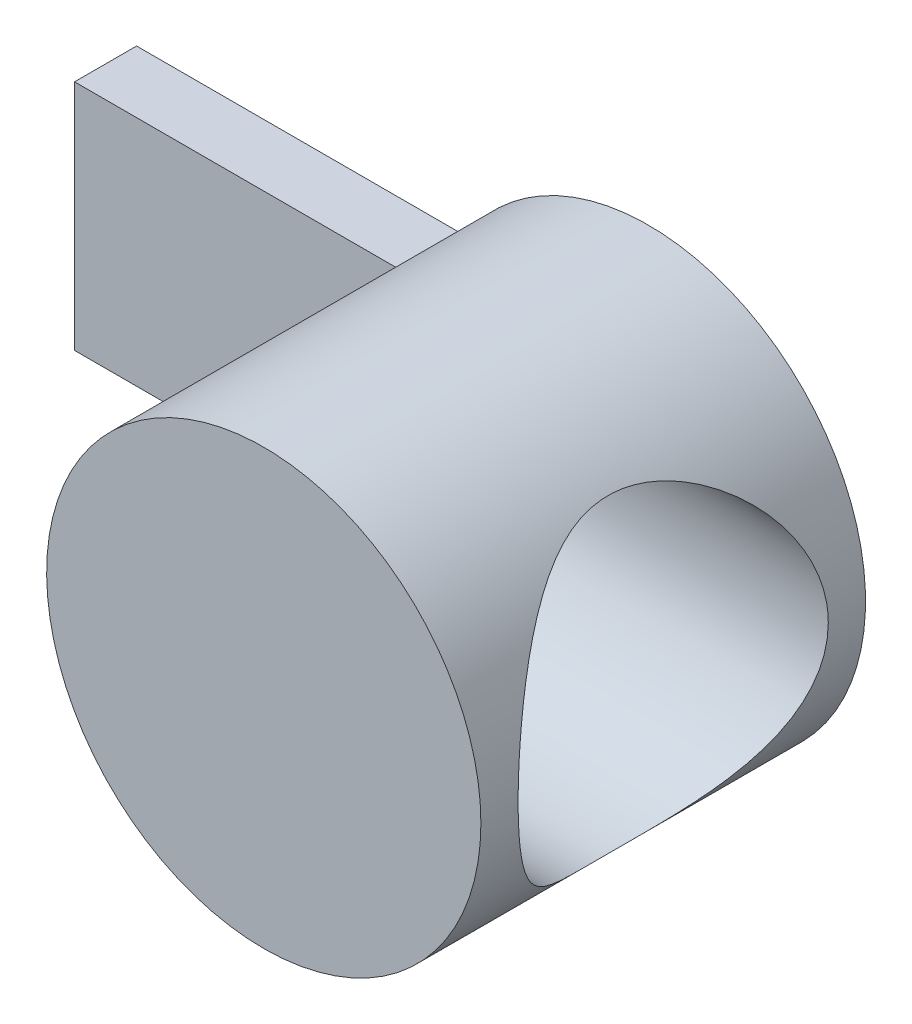
ISO-10303-21;
HEADER;
FILE_DESCRIPTION(('STEP AP214'),'2;1');
FILE_NAME('part.step','',(''),(''),'','','');
FILE_SCHEMA(('AUTOMOTIVE_DESIGN { 1 0 10303 214 1 1 1 1 }'));
ENDSEC;
DATA;
#1=APPLICATION_CONTEXT('core data for automotive mechanical design processes');
#2=APPLICATION_PROTOCOL_DEFINITION('international standard','automotive_design',2000,#1);
#3=PRODUCT_CONTEXT('',#1,'mechanical');
#4=PRODUCT('Part','Part','',(#3));
#5=PRODUCT_RELATED_PRODUCT_CATEGORY('part','',(#4));
#6=PRODUCT_DEFINITION_FORMATION('','',#4);
#7=PRODUCT_DEFINITION_CONTEXT('part definition',#1,'design');
#8=PRODUCT_DEFINITION('design','',#6,#7);
#9=PRODUCT_DEFINITION_SHAPE('','',#8);
#10=(LENGTH_UNIT() NAMED_UNIT(*) SI_UNIT(.MILLI.,.METRE.));
#11=(NAMED_UNIT(*) PLANE_ANGLE_UNIT() SI_UNIT($,.RADIAN.));
#12=(NAMED_UNIT(*) SI_UNIT($,.STERADIAN.) SOLID_ANGLE_UNIT());
#13=UNCERTAINTY_MEASURE_WITH_UNIT(LENGTH_MEASURE(1.E-05),#10,'distance_accuracy_value','');
#14=(GEOMETRIC_REPRESENTATION_CONTEXT(3) GLOBAL_UNCERTAINTY_ASSIGNED_CONTEXT((#13)) GLOBAL_UNIT_ASSIGNED_CONTEXT((#10,
#11,#12)) REPRESENTATION_CONTEXT('',''));
#15=CARTESIAN_POINT('',(0.,0.,0.));
#16=DIRECTION('',(0.,0.,1.));
#17=DIRECTION('',(1.,0.,0.));
#18=AXIS2_PLACEMENT_3D('',#15,#16,#17);
#19=CARTESIAN_POINT('',(0.,0.,12.4));
#20=DIRECTION('',(0.,0.,-1.));
#21=DIRECTION('',(-1.,0.,0.));
#22=AXIS2_PLACEMENT_3D('',#19,#20,#21);
#23=CYLINDRICAL_SURFACE('',#22,7.);
#24=CARTESIAN_POINT('',(-7.,0.,9.3));
#25=CARTESIAN_POINT('',(-6.99999920392225,-0.0826004723301821,9.29999895107974));
#26=CARTESIAN_POINT('',(-6.99853258915526,-0.165226028062722,9.29669200863502));
#27=CARTESIAN_POINT('',(-6.99271063918879,-0.329862806737177,9.2835092069616));
#28=CARTESIAN_POINT('',(-6.98835361198698,-0.411873641376801,9.27362950012956));
#29=CARTESIAN_POINT('',(-6.97106831380025,-0.656353947984344,9.23420603218676));
#30=CARTESIAN_POINT('',(-6.95392618552208,-0.81707459126903,9.19487820195585));
#31=CARTESIAN_POINT('',(-6.91024201837554,-1.12839184611795,9.091985157778));
#32=CARTESIAN_POINT('',(-6.88373344646924,-1.27902226044992,9.02850617639884));
#33=CARTESIAN_POINT('',(-6.82385816705202,-1.56736705923941,8.87949417247548));
#34=CARTESIAN_POINT('',(-6.79049305272456,-1.70508443335958,8.79396627203652));
#35=CARTESIAN_POINT('',(-6.71812812036478,-1.97149031653573,8.59831430986218));
#36=CARTESIAN_POINT('',(-6.67892881061503,-2.09937136480753,8.48716605823135));
#37=CARTESIAN_POINT('',(-6.60011042175858,-2.33539098465528,8.2456024476056));
#38=CARTESIAN_POINT('',(-6.56049110877726,-2.4435178713242,8.11517576708566));
#39=CARTESIAN_POINT('',(-6.48275819983901,-2.64310034346877,7.82973711598425));
#40=CARTESIAN_POINT('',(-6.44486051581786,-2.73324780222564,7.6737453510934));
#41=CARTESIAN_POINT('',(-6.37808030665534,-2.8856656695792,7.34690560801862));
#42=CARTESIAN_POINT('',(-6.34919255707983,-2.94795224251508,7.17606631297851));
#43=CARTESIAN_POINT('',(-6.30589043947932,-3.03944104406133,6.8336584512215));
#44=CARTESIAN_POINT('',(-6.29079733105656,-3.07020506562793,6.66259661902924));
#45=CARTESIAN_POINT('',(-6.27487325052694,-3.10263243322904,6.31712509979002));
#46=CARTESIAN_POINT('',(-6.27403285732557,-3.10431500221929,6.14271770052024));
#47=CARTESIAN_POINT('',(-6.28614249218708,-3.07969715606084,5.81206003550467));
#48=CARTESIAN_POINT('',(-6.29787545719193,-3.05586653665104,5.65557185096969));
#49=CARTESIAN_POINT('',(-6.33173023253464,-2.98508207384368,5.34910027026295));
#50=CARTESIAN_POINT('',(-6.35385435576186,-2.93812308236336,5.19911833038975));
#51=CARTESIAN_POINT('',(-6.4065108723195,-2.82148454209153,4.90590173161919));
#52=CARTESIAN_POINT('',(-6.43722044365776,-2.75131979908782,4.76289334649958));
#53=CARTESIAN_POINT('',(-6.50355949564245,-2.59061005373219,4.49007861638155));
#54=CARTESIAN_POINT('',(-6.5391910387095,-2.50005649792035,4.36027784548411));
#55=CARTESIAN_POINT('',(-6.61554078300587,-2.29088616623155,4.10435699213324));
#56=CARTESIAN_POINT('',(-6.65641777275303,-2.17040299141221,3.9798050633688));
#57=CARTESIAN_POINT('',(-6.73578240441094,-1.90991248824909,3.75210907729281));
#58=CARTESIAN_POINT('',(-6.7742693316775,-1.76989936055896,3.64897140158507));
#59=CARTESIAN_POINT('',(-6.84591281994174,-1.46902881817355,3.46431236039027));
#60=CARTESIAN_POINT('',(-6.87888139019415,-1.30768291995535,3.38350841081081));
#61=CARTESIAN_POINT('',(-6.93429049507521,-0.971852684390511,3.25075508019859));
#62=CARTESIAN_POINT('',(-6.95673761767747,-0.797376648091998,3.19878763951207));
#63=CARTESIAN_POINT('',(-6.98729435528213,-0.453273192256998,3.12864832850276));
#64=CARTESIAN_POINT('',(-6.99629273330759,-0.284152822899404,3.1083769490579));
#65=CARTESIAN_POINT('',(-7.00183669249172,0.055302211411913,3.09584808617045));
#66=CARTESIAN_POINT('',(-6.99838646319975,0.225636448583719,3.10358117789249));
#67=CARTESIAN_POINT('',(-6.97998496338462,0.552322710255016,3.1454130866267));
#68=CARTESIAN_POINT('',(-6.96570753654674,0.708915012097869,3.17796772637589));
#69=CARTESIAN_POINT('',(-6.92784742700373,1.01420149026936,3.26628970682303));
#70=CARTESIAN_POINT('',(-6.90426361059403,1.16289470182571,3.32205987568271));
#71=CARTESIAN_POINT('',(-6.84909438777876,1.45343201362728,3.45700965214373));
#72=CARTESIAN_POINT('',(-6.81728219743294,1.5949174510053,3.53686562538259));
#73=CARTESIAN_POINT('',(-6.74895803141339,1.86299030953334,3.71698300286541));
#74=CARTESIAN_POINT('',(-6.71244401454198,1.98957121423694,3.81725328059522));
#75=CARTESIAN_POINT('',(-6.6349796327071,2.2349264374936,4.04470917997253));
#76=CARTESIAN_POINT('',(-6.5939081551196,2.35226400881663,4.1734071131829));
#77=CARTESIAN_POINT('',(-6.51444139889945,2.5641546083995,4.44918266462703));
#78=CARTESIAN_POINT('',(-6.47604705067427,2.65869974317004,4.59626662361713));
#79=CARTESIAN_POINT('',(-6.4056559774341,2.82415833145881,4.90920710650133));
#80=CARTESIAN_POINT('',(-6.37382590078898,2.89448101020183,5.07541640225551));
#81=CARTESIAN_POINT('',(-6.32225755658587,3.00547362590972,5.41918720208858));
#82=CARTESIAN_POINT('',(-6.30250756681331,3.04617231656578,5.59673751571235));
#83=CARTESIAN_POINT('',(-6.27928486291416,3.09373854164963,5.9420262458586));
#84=CARTESIAN_POINT('',(-6.27457978714274,3.1031699433841,6.10932920549811));
#85=CARTESIAN_POINT('',(-6.27863612118093,3.09495641516909,6.44308355830446));
#86=CARTESIAN_POINT('',(-6.28739471419524,3.07731714879828,6.60953512228618));
#87=CARTESIAN_POINT('',(-6.31620554797265,3.01770297873168,6.92660854462708));
#88=CARTESIAN_POINT('',(-6.33555708545857,2.97723361477951,7.07758371882228));
#89=CARTESIAN_POINT('',(-6.38273680736285,2.87468918464525,7.3705860881766));
#90=CARTESIAN_POINT('',(-6.41056743775042,2.81260788331605,7.51261068707141));
#91=CARTESIAN_POINT('',(-6.47376726319116,2.6640646190602,7.79361644150932));
#92=CARTESIAN_POINT('',(-6.50950448670628,2.57629841908578,7.93182345761236));
#93=CARTESIAN_POINT('',(-6.58360232894903,2.380570945934,8.19234706879388));
#94=CARTESIAN_POINT('',(-6.62196402921168,2.27260131482343,8.31465705183381));
#95=CARTESIAN_POINT('',(-6.70097060806761,2.02850610359402,8.55084120757505));
#96=CARTESIAN_POINT('',(-6.74152553582918,1.89075199028391,8.66306771609541));
#97=CARTESIAN_POINT('',(-6.81711404156367,1.59683926292868,8.86301335953832));
#98=CARTESIAN_POINT('',(-6.85214509794284,1.44067230011921,8.95072131601678));
#99=CARTESIAN_POINT('',(-6.89742322426797,1.1968062420193,9.06103704115569));
#100=CARTESIAN_POINT('',(-6.91125017984811,1.11437615014362,9.09414773548195));
#101=CARTESIAN_POINT('',(-6.93621412332348,0.946626613697481,9.15326772962415));
#102=CARTESIAN_POINT('',(-6.94735240296889,0.861308579168792,9.17928044038893));
#103=CARTESIAN_POINT('',(-6.96658500833041,0.688641654886188,9.22385659736424));
#104=CARTESIAN_POINT('',(-6.97468662123244,0.601298168057098,9.24243788428135));
#105=CARTESIAN_POINT('',(-6.98763502402816,0.425139501168101,9.27200613974835));
#106=CARTESIAN_POINT('',(-6.99248408251947,0.336325391237433,9.28299840166231));
#107=CARTESIAN_POINT('',(-6.99708708624893,0.206077044210543,9.29341789744742));
#108=CARTESIAN_POINT('',(-6.99817853645028,0.164910252675197,9.29588518180084));
#109=CARTESIAN_POINT('',(-6.9996351961203,0.082497726740249,9.29917650406863));
#110=CARTESIAN_POINT('',(-7.00000039757391,0.0412519914744309,9.30000052384749));
#111=CARTESIAN_POINT('',(-7.,0.,9.3));
#112=B_SPLINE_CURVE_WITH_KNOTS('',3,(#24,#25,#26,#27,#28,#29,#30,#31,#32,#33,#34,#35,#36,#37,
#38,#39,#40,#41,#42,#43,#44,#45,#46,#47,#48,#49,#50,#51,#52,#53,#54,#55,#56,#57,#58,#59,#60,#61,
#62,#63,#64,#65,#66,#67,#68,#69,#70,#71,#72,#73,#74,#75,#76,#77,#78,#79,#80,#81,#82,#83,#84,#85,
#86,#87,#88,#89,#90,#91,#92,#93,#94,#95,#96,#97,#98,#99,#100,#101,#102,#103,#104,#105,#106,#107,
#108,#109,#110,#111),.UNSPECIFIED.,.T.,.F.,(4,2,2,2,2,2,2,2,2,2,2,2,2,2,2,2,2,2,2,2,2,2,2,2,2,2,
2,2,2,2,2,2,2,2,2,2,2,2,2,2,2,2,2,4),(0.,0.247756788055554,0.495658737198749,0.992044630234383,
1.48667454444317,1.98118965633366,2.5006840191714,3.020484683399,3.57003144751924,
4.1192589605216,4.6397235516738,5.15984410049578,5.6338122404858,6.10788592749307,
6.59257463123686,7.07746705039858,7.60922292755884,8.141137045125,8.68854995296803,
9.23561964042515,9.74463230675549,10.2534736820574,10.733008502137,11.2126017572017,
11.7071650616782,12.2019437987223,12.7363418968097,13.2709248029259,13.8177502093522,
14.3640441447254,14.8642626981315,15.3643766127848,15.834826048662,16.3054113240846,
16.8060613839441,17.3069190168579,17.8511484172661,18.3956255383699,18.6650270977702,
18.9342989668481,19.2029204544772,19.4713543881329,19.595086708619,19.7188203946413),.UNSPECIFIED.);
#113=CARTESIAN_POINT('',(-7.,0.,9.3));
#114=VERTEX_POINT('',#113);
#115=EDGE_CURVE('E39',#114,#114,#112,.T.);
#116=ORIENTED_EDGE('',*,*,#115,.T.);
#117=EDGE_LOOP('',(#116));
#118=FACE_BOUND('',#117,.T.);
#119=CARTESIAN_POINT('',(7.,0.,1.2));
#120=CARTESIAN_POINT('',(7.00000020838972,-0.123706830347803,1.19999977645311));
#121=CARTESIAN_POINT('',(6.9967139987286,-0.247410973485874,1.20459731763598));
#122=CARTESIAN_POINT('',(6.98364877001323,-0.493842597599125,1.2229133669717));
#123=CARTESIAN_POINT('',(6.97386724806996,-0.616569683621373,1.23663539113509));
#124=CARTESIAN_POINT('',(6.94804684346392,-0.860016934543372,1.27298079601445));
#125=CARTESIAN_POINT('',(6.93200830974386,-0.980737210968061,1.29560368034545));
#126=CARTESIAN_POINT('',(6.89403980063153,-1.21935225441358,1.34941777791251));
#127=CARTESIAN_POINT('',(6.87210728454189,-1.33724577898901,1.38061268639059));
#128=CARTESIAN_POINT('',(6.82296817560751,-1.56876671294682,1.45094481401108));
#129=CARTESIAN_POINT('',(6.79579130680713,-1.68241404829323,1.4900373269336));
#130=CARTESIAN_POINT('',(6.73663568699671,-1.90554075562293,1.57580066790878));
#131=CARTESIAN_POINT('',(6.70465504948954,-2.01501846887803,1.622474473814));
#132=CARTESIAN_POINT('',(6.60241573373069,-2.33634582627582,1.77310823468496));
#133=CARTESIAN_POINT('',(6.5258150865612,-2.54129209226534,1.88774310148879));
#134=CARTESIAN_POINT('',(6.35349136110254,-2.94722710575678,2.15303366766681));
#135=CARTESIAN_POINT('',(6.25666965742087,-3.14621427453547,2.30599715160335));
#136=CARTESIAN_POINT('',(6.05567589289303,-3.51757946240277,2.63787428407187));
#137=CARTESIAN_POINT('',(5.95149294556457,-3.68991681632733,2.81682679821524));
#138=CARTESIAN_POINT('',(5.78580169781969,-3.9417150806784,3.12032565347204));
#139=CARTESIAN_POINT('',(5.72420876579618,-4.03039974891772,3.23731537762762));
#140=CARTESIAN_POINT('',(5.60277478999017,-4.19756740724372,3.47932676985867));
#141=CARTESIAN_POINT('',(5.54293422728727,-4.2760476158605,3.6043506140081));
#142=CARTESIAN_POINT('',(5.4270606468648,-4.42218280560563,3.86201101128069));
#143=CARTESIAN_POINT('',(5.37102235890232,-4.48985295423517,3.99463653688092));
#144=CARTESIAN_POINT('',(5.2649167619883,-4.61381658166145,4.26734449592868));
#145=CARTESIAN_POINT('',(5.21484853251546,-4.67011181528465,4.40742577494594));
#146=CARTESIAN_POINT('',(5.10685206277554,-4.78838198824486,4.74607281108786));
#147=CARTESIAN_POINT('',(5.0524828289815,-4.84522975768853,4.94768828615543));
#148=CARTESIAN_POINT('',(4.98781463924069,-4.91148095083961,5.25738617406959));
#149=CARTESIAN_POINT('',(4.96907802082194,-4.93038988462307,5.36177710605744));
#150=CARTESIAN_POINT('',(4.93791198912564,-4.96160430011133,5.57246334187762));
#151=CARTESIAN_POINT('',(4.92548008185896,-4.97391239305786,5.67875787543776));
#152=CARTESIAN_POINT('',(4.9074041133857,-4.99174806834479,5.89322513655137));
#153=CARTESIAN_POINT('',(4.90180679564492,-4.99722896284026,6.00140572146472));
#154=CARTESIAN_POINT('',(4.89781588192549,-5.00114067376557,6.21802681215551));
#155=CARTESIAN_POINT('',(4.89942206309633,-4.9995717082929,6.32646730978846));
#156=CARTESIAN_POINT('',(4.9097647058501,-4.9894149735773,6.54272888939918));
#157=CARTESIAN_POINT('',(4.91850485918776,-4.98082357029426,6.65054962155586));
#158=CARTESIAN_POINT('',(4.94272114520741,-4.95679292982465,6.86469846955641));
#159=CARTESIAN_POINT('',(4.95820063893991,-4.94135027570228,6.97102581326793));
#160=CARTESIAN_POINT('',(4.99760451378595,-4.90151284488867,7.19482508146929));
#161=CARTESIAN_POINT('',(5.02235272142097,-4.87622911468844,7.31199391044316));
#162=CARTESIAN_POINT('',(5.07843189223478,-4.81779740683445,7.54276673574008));
#163=CARTESIAN_POINT('',(5.10976728413097,-4.78464413635863,7.65636827432982));
#164=CARTESIAN_POINT('',(5.21188277843352,-4.6740034304818,7.99137244482137));
#165=CARTESIAN_POINT('',(5.29073017996701,-4.58537486342022,8.20675876983911));
#166=CARTESIAN_POINT('',(5.43117977056448,-4.41699659938633,8.5479540095639));
#167=CARTESIAN_POINT('',(5.48936415421452,-4.34470821312944,8.67905841197645));
#168=CARTESIAN_POINT('',(5.60880434984662,-4.18937966154036,8.93336368670042));
#169=CARTESIAN_POINT('',(5.67006102833912,-4.10633645234857,9.05656230667668));
#170=CARTESIAN_POINT('',(5.793752422172,-3.9298928370481,9.29482566922712));
#171=CARTESIAN_POINT('',(5.85618806526486,-3.83648396587932,9.40988363634829));
#172=CARTESIAN_POINT('',(5.98049354239989,-3.63967604580747,9.63142884548284));
#173=CARTESIAN_POINT('',(6.04236343357916,-3.53627801821644,9.73791696165918));
#174=CARTESIAN_POINT('',(6.16459711373884,-3.31865566402193,9.9428718998703));
#175=CARTESIAN_POINT('',(6.22493938999143,-3.20433257193991,10.0412468818249));
#176=CARTESIAN_POINT('',(6.34192222059401,-2.96607983417464,10.2280612669858));
#177=CARTESIAN_POINT('',(6.3985632904349,-2.84215153154958,10.3165020550304));
#178=CARTESIAN_POINT('',(6.50656183204898,-2.58534749281631,10.482441595));
#179=CARTESIAN_POINT('',(6.55792871427446,-2.45248841807631,10.5599599306667));
#180=CARTESIAN_POINT('',(6.65402794776657,-2.17829997878349,10.7032109939681));
#181=CARTESIAN_POINT('',(6.69876279357063,-2.03697382721867,10.7689481548617));
#182=CARTESIAN_POINT('',(6.76979900167759,-1.78393161589397,10.8723873256715));
#183=CARTESIAN_POINT('',(6.79788920127107,-1.67388190691354,10.9129602050567));
#184=CARTESIAN_POINT('',(6.84910120159546,-1.45016241863131,10.9865317316341));
#185=CARTESIAN_POINT('',(6.87222406946424,-1.33649342290229,11.0195320057622));
#186=CARTESIAN_POINT('',(6.91302945246583,-1.10620699746514,11.0775404731357));
#187=CARTESIAN_POINT('',(6.93071352231445,-0.98959042067674,11.1025509503959));
#188=CARTESIAN_POINT('',(6.96026202465165,-0.75419808669737,11.1442354109564));
#189=CARTESIAN_POINT('',(6.97212907243022,-0.635423324765778,11.1609131406635));
#190=CARTESIAN_POINT('',(6.98981803267421,-0.39609653194057,11.1857429290164));
#191=CARTESIAN_POINT('',(6.99561783247229,-0.275539612785596,11.1938638021502));
#192=CARTESIAN_POINT('',(7.00095849009119,-0.0340589156116064,11.2013424865321));
#193=CARTESIAN_POINT('',(7.00050163923066,0.0868647118914876,11.200703505825));
#194=CARTESIAN_POINT('',(6.99334434902713,0.328194873869988,11.1906790582753));
#195=CARTESIAN_POINT('',(6.98664219024223,0.448601256767225,11.1812911827097));
#196=CARTESIAN_POINT('',(6.96714954851426,0.687926838509061,11.1539140939111));
#197=CARTESIAN_POINT('',(6.95435917772169,0.806846064707051,11.1359250391197));
#198=CARTESIAN_POINT('',(6.92373169105251,1.03669034077474,11.0926764228558));
#199=CARTESIAN_POINT('',(6.90616594722286,1.14772530670986,11.0678068038953));
#200=CARTESIAN_POINT('',(6.86612520630985,1.36703042618004,11.0108296504221));
#201=CARTESIAN_POINT('',(6.84364861236167,1.47529966756195,10.9787197614764));
#202=CARTESIAN_POINT('',(6.76946421834351,1.79502091246228,10.8720751794697));
#203=CARTESIAN_POINT('',(6.71097815818561,2.00155706076148,10.7871927909131));
#204=CARTESIAN_POINT('',(6.57387491863986,2.41580133963063,10.5842822855905));
#205=CARTESIAN_POINT('',(6.49391167742686,2.62191172181248,10.4639437037929));
#206=CARTESIAN_POINT('',(6.32248637138391,3.01190946129235,10.1980208898307));
#207=CARTESIAN_POINT('',(6.23101540686785,3.1957794003542,10.0524170849791));
#208=CARTESIAN_POINT('',(6.0250635299762,3.57103500131532,9.71046418552866));
#209=CARTESIAN_POINT('',(5.9094144469246,3.75775754044495,9.50970030994848));
#210=CARTESIAN_POINT('',(5.67976360472222,4.09660125204316,9.07973003591422));
#211=CARTESIAN_POINT('',(5.56576275441127,4.24870396900494,8.85050856713161));
#212=CARTESIAN_POINT('',(5.36830225813508,4.49468870359569,8.40283415030589));
#213=CARTESIAN_POINT('',(5.28284827698324,4.59394222437956,8.18822765934173));
#214=CARTESIAN_POINT('',(5.13141345636178,4.76250754552228,7.74119845383935));
#215=CARTESIAN_POINT('',(5.06539151754964,4.83188268572654,7.50881467056927));
#216=CARTESIAN_POINT('',(4.97281140949568,4.92694108133025,7.07463559032775));
#217=CARTESIAN_POINT('',(4.94119323485648,4.95835553271174,6.87520480558969));
#218=CARTESIAN_POINT('',(4.90241792810042,4.99670946606584,6.47172766179928));
#219=CARTESIAN_POINT('',(4.89523352826001,5.00367623156318,6.26768670389023));
#220=CARTESIAN_POINT('',(4.90648075072078,4.99264295050726,5.86101491332858));
#221=CARTESIAN_POINT('',(4.92491410752053,4.97464121341455,5.65838417709128));
#222=CARTESIAN_POINT('',(4.98443760917989,4.9149871096555,5.25997752126032));
#223=CARTESIAN_POINT('',(5.02556280172843,4.87329815495586,5.06421270482885));
#224=CARTESIAN_POINT('',(5.1420026145228,4.75069025016355,4.61855770549582));
#225=CARTESIAN_POINT('',(5.22418017553764,4.66126522644891,4.37280248816455));
#226=CARTESIAN_POINT('',(5.36059508623753,4.50210411725644,4.02107405363224));
#227=CARTESIAN_POINT('',(5.40832357564202,4.44479567507594,3.90652093393072));
#228=CARTESIAN_POINT('',(5.50678597491543,4.32220971449382,3.68311353915327));
#229=CARTESIAN_POINT('',(5.55751965778047,4.25693279761429,3.57425883480216));
#230=CARTESIAN_POINT('',(5.71505652733019,4.04590690194063,3.25074078714441));
#231=CARTESIAN_POINT('',(5.82467625637419,3.88776756391514,3.0452887413705));
#232=CARTESIAN_POINT('',(5.98735914065858,3.6279551096738,2.75693618844453));
#233=CARTESIAN_POINT('',(6.04132015327539,3.53753675683206,2.66408465013388));
#234=CARTESIAN_POINT('',(6.14770901514369,3.34923083939283,2.48523041156896));
#235=CARTESIAN_POINT('',(6.2001365887339,3.25134194311757,2.39922893799781));
#236=CARTESIAN_POINT('',(6.31122907951896,3.03086404240044,2.22038591721264));
#237=CARTESIAN_POINT('',(6.36941716980575,2.90692152521496,2.12890950870005));
#238=CARTESIAN_POINT('',(6.48069645050252,2.64956836988843,1.95692065557396));
#239=CARTESIAN_POINT('',(6.53378994050182,2.51616205124388,1.87640325737379));
#240=CARTESIAN_POINT('',(6.63333305417821,2.24060912964319,1.72739711081934));
#241=CARTESIAN_POINT('',(6.67978935099169,2.09847151388446,1.6588962648185));
#242=CARTESIAN_POINT('',(6.76463878724721,1.80631427486925,1.53498359895766));
#243=CARTESIAN_POINT('',(6.80303505370809,1.65629773671334,1.47956670192386));
#244=CARTESIAN_POINT('',(6.86305258081175,1.38331089815878,1.39352344182651));
#245=CARTESIAN_POINT('',(6.88650604727471,1.26160961479056,1.36012583943568));
#246=CARTESIAN_POINT('',(6.92714135495755,1.0150426318104,1.30247951146532));
#247=CARTESIAN_POINT('',(6.94432457497392,0.890177634349851,1.27822877449537));
#248=CARTESIAN_POINT('',(6.97198481931339,0.638329109483767,1.23927826321901));
#249=CARTESIAN_POINT('',(6.98246701467067,0.511347293416879,1.22457112419438));
#250=CARTESIAN_POINT('',(6.99647449097442,0.256242689441558,1.20493211695579));
#251=CARTESIAN_POINT('',(6.99999978417626,0.128119903543471,1.20000023152163));
#252=CARTESIAN_POINT('',(7.,0.,1.2));
#253=B_SPLINE_CURVE_WITH_KNOTS('',3,(#119,#120,#121,#122,#123,#124,#125,#126,#127,#128,#129,
#130,#131,#132,#133,#134,#135,#136,#137,#138,#139,#140,#141,#142,#143,#144,#145,#146,#147,#148,
#149,#150,#151,#152,#153,#154,#155,#156,#157,#158,#159,#160,#161,#162,#163,#164,#165,#166,#167,
#168,#169,#170,#171,#172,#173,#174,#175,#176,#177,#178,#179,#180,#181,#182,#183,#184,#185,#186,
#187,#188,#189,#190,#191,#192,#193,#194,#195,#196,#197,#198,#199,#200,#201,#202,#203,#204,#205,
#206,#207,#208,#209,#210,#211,#212,#213,#214,#215,#216,#217,#218,#219,#220,#221,#222,#223,#224,
#225,#226,#227,#228,#229,#230,#231,#232,#233,#234,#235,#236,#237,#238,#239,#240,#241,#242,#243,
#244,#245,#246,#247,#248,#249,#250,#251,#252),.UNSPECIFIED.,.T.,.F.,(4,2,2,2,2,2,2,2,2,2,2,2,2,
2,2,2,2,2,2,2,2,2,2,2,2,2,2,2,2,2,2,2,2,2,2,2,2,2,2,2,2,2,2,2,2,2,2,2,2,2,2,2,2,2,2,2,2,2,2,2,2,
2,2,2,2,2,4),(0.,0.370988075311342,0.742119189353149,1.11322960901298,1.48450025920444,
1.85372534219339,2.22309580520344,2.96119440682996,3.76545645669383,4.57093387736644,
5.04808282383801,5.52536155725331,6.00196462889924,6.47849411798938,7.12486898649108,
7.44773292534192,7.77046904731894,8.09540029733772,8.42032149521341,8.74541094303565,
9.07066270584137,9.43729317449982,9.80417093025883,10.5385885670457,11.0199765172867,
11.501501010235,11.9834216722646,12.4652931137676,12.9520296640933,13.4386982783501,
13.9244828884573,14.4100843121038,14.7715471013432,15.1329321592677,15.4942138166987,
15.8553328952545,16.2177635696493,16.5800615177667,16.9424592422916,17.304850291374,
17.6498662512386,17.9949945676154,18.6847309611871,19.4371210061711,20.190096543024,
21.0793568967469,21.9690902023821,22.7207890020039,23.4708863194346,24.0812720855668,
24.690976446486,25.3007220906012,25.9114121377249,26.7290171085949,27.1388076467791,
27.5485672699122,28.3895670350435,28.810455633468,29.2314194343296,29.724740195124,
30.2178372239682,30.7104349429707,31.2028411960805,31.587446153124,31.9719664863837,
32.356189734384,32.7404123055309),.UNSPECIFIED.);
#254=CARTESIAN_POINT('',(7.,0.,1.2));
#255=VERTEX_POINT('',#254);
#256=EDGE_CURVE('E11',#255,#255,#253,.T.);
#257=ORIENTED_EDGE('',*,*,#256,.T.);
#258=EDGE_LOOP('',(#257));
#259=FACE_BOUND('',#258,.T.);
#260=CARTESIAN_POINT('',(0.,0.,12.4));
#261=DIRECTION('',(0.,0.,1.));
#262=DIRECTION('',(1.,0.,0.));
#263=AXIS2_PLACEMENT_3D('',#260,#261,#262);
#264=CIRCLE('',#263,7.);
#265=CARTESIAN_POINT('',(7.,0.,12.4));
#266=VERTEX_POINT('',#265);
#267=EDGE_CURVE('E115',#266,#266,#264,.T.);
#268=ORIENTED_EDGE('',*,*,#267,.F.);
#269=EDGE_LOOP('',(#268));
#270=FACE_BOUND('',#269,.T.);
#271=DIRECTION('',(0.,0.,-1.));
#272=VECTOR('',#271,1.);
#273=CARTESIAN_POINT('',(-5.91079520876845,3.75,2.));
#274=LINE('',#273,#272);
#275=CARTESIAN_POINT('',(-5.91079520876845,3.75,2.));
#276=VERTEX_POINT('',#275);
#277=CARTESIAN_POINT('',(-5.91079520876845,3.75,0.));
#278=VERTEX_POINT('',#277);
#279=EDGE_CURVE('E55',#276,#278,#274,.T.);
#280=ORIENTED_EDGE('',*,*,#279,.F.);
#281=CARTESIAN_POINT('',(0.,0.,2.));
#282=DIRECTION('',(0.,0.,-1.));
#283=DIRECTION('',(-1.,0.,0.));
#284=AXIS2_PLACEMENT_3D('',#281,#282,#283);
#285=CIRCLE('',#284,7.);
#286=CARTESIAN_POINT('',(-5.91079520876845,-3.75,2.));
#287=VERTEX_POINT('',#286);
#288=EDGE_CURVE('E48',#287,#276,#285,.T.);
#289=ORIENTED_EDGE('',*,*,#288,.F.);
#290=DIRECTION('',(0.,0.,-1.));
#291=VECTOR('',#290,1.);
#292=CARTESIAN_POINT('',(-5.91079520876845,-3.75,2.));
#293=LINE('',#292,#291);
#294=CARTESIAN_POINT('',(-5.91079520876845,-3.75,0.));
#295=VERTEX_POINT('',#294);
#296=EDGE_CURVE('E101',#287,#295,#293,.T.);
#297=ORIENTED_EDGE('',*,*,#296,.T.);
#298=CARTESIAN_POINT('',(0.,0.,0.));
#299=DIRECTION('',(0.,0.,1.));
#300=DIRECTION('',(1.,0.,0.));
#301=AXIS2_PLACEMENT_3D('',#298,#299,#300);
#302=CIRCLE('',#301,7.);
#303=EDGE_CURVE('E114',#295,#278,#302,.T.);
#304=ORIENTED_EDGE('',*,*,#303,.T.);
#305=EDGE_LOOP('',(#280,#289,#297,#304));
#306=FACE_BOUND('',#305,.T.);
#307=ADVANCED_FACE('F35',(#118,#259,#270,#306),#23,.T.);
#308=CARTESIAN_POINT('',(0.,0.,12.4));
#309=DIRECTION('',(0.,0.,1.));
#310=DIRECTION('',(1.,0.,0.));
#311=AXIS2_PLACEMENT_3D('',#308,#309,#310);
#312=PLANE('',#311);
#313=ORIENTED_EDGE('',*,*,#267,.T.);
#314=EDGE_LOOP('',(#313));
#315=FACE_BOUND('',#314,.T.);
#316=ADVANCED_FACE('F141',(#315),#312,.T.);
#317=CARTESIAN_POINT('',(0.,0.,0.));
#318=DIRECTION('',(0.,0.,1.));
#319=DIRECTION('',(1.,0.,0.));
#320=AXIS2_PLACEMENT_3D('',#317,#318,#319);
#321=PLANE('',#320);
#322=ORIENTED_EDGE('',*,*,#303,.F.);
#323=DIRECTION('',(1.,0.,0.));
#324=VECTOR('',#323,1.);
#325=CARTESIAN_POINT('',(-5.91079520876845,-3.75,0.));
#326=LINE('',#325,#324);
#327=CARTESIAN_POINT('',(-16.5,-3.75,0.));
#328=VERTEX_POINT('',#327);
#329=EDGE_CURVE('E85',#328,#295,#326,.T.);
#330=ORIENTED_EDGE('',*,*,#329,.F.);
#331=DIRECTION('',(0.,-1.,0.));
#332=VECTOR('',#331,1.);
#333=CARTESIAN_POINT('',(-16.5,3.75,0.));
#334=LINE('',#333,#332);
#335=CARTESIAN_POINT('',(-16.5,3.75,0.));
#336=VERTEX_POINT('',#335);
#337=EDGE_CURVE('E106',#336,#328,#334,.T.);
#338=ORIENTED_EDGE('',*,*,#337,.F.);
#339=DIRECTION('',(-1.,0.,0.));
#340=VECTOR('',#339,1.);
#341=CARTESIAN_POINT('',(-5.91079520876845,3.75,0.));
#342=LINE('',#341,#340);
#343=EDGE_CURVE('E91',#278,#336,#342,.T.);
#344=ORIENTED_EDGE('',*,*,#343,.F.);
#345=EDGE_LOOP('',(#322,#330,#338,#344));
#346=FACE_BOUND('',#345,.T.);
#347=ADVANCED_FACE('F140',(#346),#321,.F.);
#348=CARTESIAN_POINT('',(-5.91079520876845,3.75,2.));
#349=DIRECTION('',(0.,-1.,0.));
#350=DIRECTION('',(1.,0.,0.));
#351=AXIS2_PLACEMENT_3D('',#348,#349,#350);
#352=PLANE('',#351);
#353=ORIENTED_EDGE('',*,*,#343,.T.);
#354=DIRECTION('',(0.,0.,-1.));
#355=VECTOR('',#354,1.);
#356=CARTESIAN_POINT('',(-16.5,3.75,2.));
#357=LINE('',#356,#355);
#358=CARTESIAN_POINT('',(-16.5,3.75,2.));
#359=VERTEX_POINT('',#358);
#360=EDGE_CURVE('E88',#359,#336,#357,.T.);
#361=ORIENTED_EDGE('',*,*,#360,.F.);
#362=DIRECTION('',(-1.,0.,0.));
#363=VECTOR('',#362,1.);
#364=CARTESIAN_POINT('',(-5.91079520876845,3.75,2.));
#365=LINE('',#364,#363);
#366=EDGE_CURVE('E78',#276,#359,#365,.T.);
#367=ORIENTED_EDGE('',*,*,#366,.F.);
#368=ORIENTED_EDGE('',*,*,#279,.T.);
#369=EDGE_LOOP('',(#353,#361,#367,#368));
#370=FACE_BOUND('',#369,.T.);
#371=ADVANCED_FACE('F89',(#370),#352,.F.);
#372=CARTESIAN_POINT('',(-16.5,3.75,2.));
#373=DIRECTION('',(1.,0.,0.));
#374=DIRECTION('',(0.,0.,-1.));
#375=AXIS2_PLACEMENT_3D('',#372,#373,#374);
#376=PLANE('',#375);
#377=ORIENTED_EDGE('',*,*,#337,.T.);
#378=DIRECTION('',(0.,0.,-1.));
#379=VECTOR('',#378,1.);
#380=CARTESIAN_POINT('',(-16.5,-3.75,2.));
#381=LINE('',#380,#379);
#382=CARTESIAN_POINT('',(-16.5,-3.75,2.));
#383=VERTEX_POINT('',#382);
#384=EDGE_CURVE('E94',#383,#328,#381,.T.);
#385=ORIENTED_EDGE('',*,*,#384,.F.);
#386=DIRECTION('',(0.,-1.,0.));
#387=VECTOR('',#386,1.);
#388=CARTESIAN_POINT('',(-16.5,3.75,2.));
#389=LINE('',#388,#387);
#390=EDGE_CURVE('E82',#359,#383,#389,.T.);
#391=ORIENTED_EDGE('',*,*,#390,.F.);
#392=ORIENTED_EDGE('',*,*,#360,.T.);
#393=EDGE_LOOP('',(#377,#385,#391,#392));
#394=FACE_BOUND('',#393,.T.);
#395=ADVANCED_FACE('F96',(#394),#376,.F.);
#396=CARTESIAN_POINT('',(-5.91079520876845,-3.75,2.));
#397=DIRECTION('',(0.,1.,0.));
#398=DIRECTION('',(-1.,0.,0.));
#399=AXIS2_PLACEMENT_3D('',#396,#397,#398);
#400=PLANE('',#399);
#401=ORIENTED_EDGE('',*,*,#329,.T.);
#402=ORIENTED_EDGE('',*,*,#296,.F.);
#403=DIRECTION('',(1.,0.,0.));
#404=VECTOR('',#403,1.);
#405=CARTESIAN_POINT('',(-5.91079520876845,-3.75,2.));
#406=LINE('',#405,#404);
#407=EDGE_CURVE('E99',#383,#287,#406,.T.);
#408=ORIENTED_EDGE('',*,*,#407,.F.);
#409=ORIENTED_EDGE('',*,*,#384,.T.);
#410=EDGE_LOOP('',(#401,#402,#408,#409));
#411=FACE_BOUND('',#410,.T.);
#412=ADVANCED_FACE('F132',(#411),#400,.F.);
#413=CARTESIAN_POINT('',(0.,0.,2.));
#414=DIRECTION('',(0.,0.,-1.));
#415=DIRECTION('',(-1.,0.,0.));
#416=AXIS2_PLACEMENT_3D('',#413,#414,#415);
#417=PLANE('',#416);
#418=ORIENTED_EDGE('',*,*,#407,.T.);
#419=ORIENTED_EDGE('',*,*,#288,.T.);
#420=ORIENTED_EDGE('',*,*,#366,.T.);
#421=ORIENTED_EDGE('',*,*,#390,.T.);
#422=EDGE_LOOP('',(#418,#419,#420,#421));
#423=FACE_BOUND('',#422,.T.);
#424=ADVANCED_FACE('F80',(#423),#417,.F.);
#425=CARTESIAN_POINT('',(-1.5,0.,6.2));
#426=DIRECTION('',(1.,0.,0.));
#427=DIRECTION('',(0.,0.,-1.));
#428=AXIS2_PLACEMENT_3D('',#425,#426,#427);
#429=CYLINDRICAL_SURFACE('',#428,5.);
#430=CARTESIAN_POINT('',(-1.5,0.,6.2));
#431=DIRECTION('',(1.,0.,0.));
#432=DIRECTION('',(0.,0.,-1.));
#433=AXIS2_PLACEMENT_3D('',#430,#431,#432);
#434=CIRCLE('',#433,5.);
#435=CARTESIAN_POINT('',(-1.5,0.,1.2));
#436=VERTEX_POINT('',#435);
#437=EDGE_CURVE('E107',#436,#436,#434,.T.);
#438=ORIENTED_EDGE('',*,*,#437,.F.);
#439=EDGE_LOOP('',(#438));
#440=FACE_BOUND('',#439,.T.);
#441=ORIENTED_EDGE('',*,*,#256,.F.);
#442=EDGE_LOOP('',(#441));
#443=FACE_BOUND('',#442,.T.);
#444=ADVANCED_FACE('F123',(#440,#443),#429,.F.);
#445=CARTESIAN_POINT('',(-1.5,0.,6.2));
#446=DIRECTION('',(1.,0.,0.));
#447=DIRECTION('',(0.,0.,-1.));
#448=AXIS2_PLACEMENT_3D('',#445,#446,#447);
#449=PLANE('',#448);
#450=CARTESIAN_POINT('',(-1.5,0.,6.2));
#451=DIRECTION('',(1.,0.,0.));
#452=DIRECTION('',(0.,0.,-1.));
#453=AXIS2_PLACEMENT_3D('',#450,#451,#452);
#454=CIRCLE('',#453,3.1);
#455=CARTESIAN_POINT('',(-1.5,0.,3.1));
#456=VERTEX_POINT('',#455);
#457=EDGE_CURVE('E160',#456,#456,#454,.T.);
#458=ORIENTED_EDGE('',*,*,#457,.F.);
#459=EDGE_LOOP('',(#458));
#460=FACE_BOUND('',#459,.T.);
#461=ORIENTED_EDGE('',*,*,#437,.T.);
#462=EDGE_LOOP('',(#461));
#463=FACE_BOUND('',#462,.T.);
#464=ADVANCED_FACE('F128',(#460,#463),#449,.T.);
#465=CARTESIAN_POINT('',(-16.5,0.,6.2));
#466=DIRECTION('',(1.,0.,0.));
#467=DIRECTION('',(0.,0.,-1.));
#468=AXIS2_PLACEMENT_3D('',#465,#466,#467);
#469=CYLINDRICAL_SURFACE('',#468,3.1);
#470=ORIENTED_EDGE('',*,*,#457,.T.);
#471=EDGE_LOOP('',(#470));
#472=FACE_BOUND('',#471,.T.);
#473=ORIENTED_EDGE('',*,*,#115,.F.);
#474=EDGE_LOOP('',(#473));
#475=FACE_BOUND('',#474,.T.);
#476=ADVANCED_FACE('F166',(#472,#475),#469,.F.);
#477=CLOSED_SHELL('',(#307,#316,#347,#371,#395,#412,#424,#444,#464,#476));
#478=MANIFOLD_SOLID_BREP('B2',#477);
#479=ADVANCED_BREP_SHAPE_REPRESENTATION('',(#18,#478),#14);
#480=SHAPE_DEFINITION_REPRESENTATION(#9,#479);
ENDSEC;
END-ISO-10303-21;
